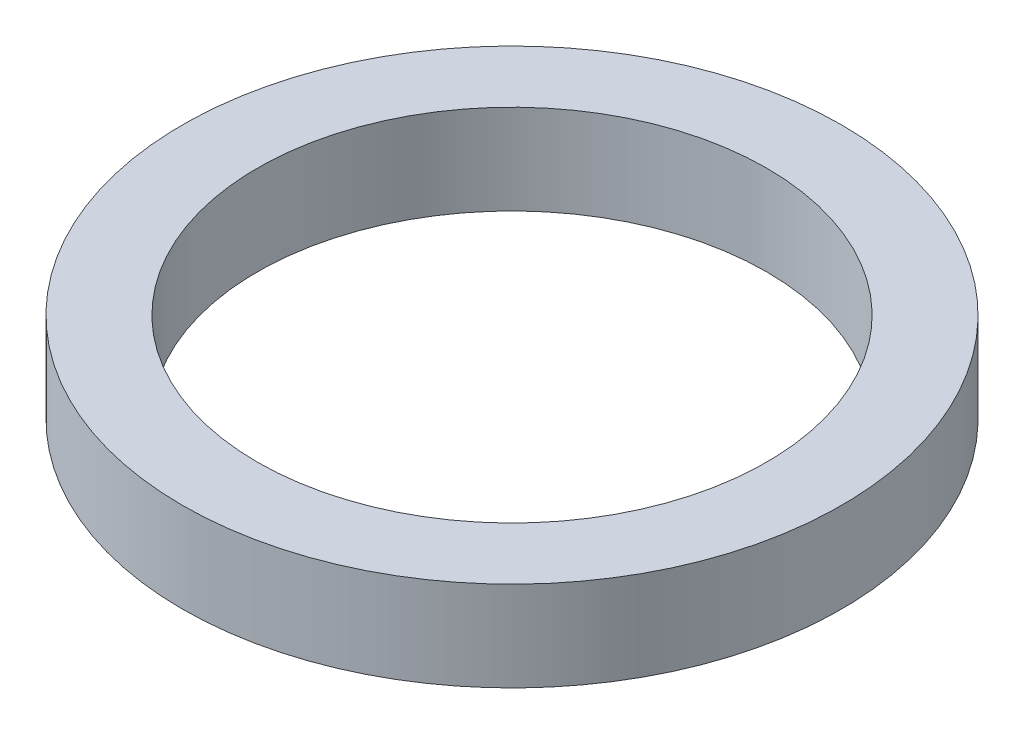
ISO-10303-21;
HEADER;
FILE_DESCRIPTION(('STEP AP214'),'2;1');
FILE_NAME('part.step','',(''),(''),'','','');
FILE_SCHEMA(('AUTOMOTIVE_DESIGN { 1 0 10303 214 1 1 1 1 }'));
ENDSEC;
DATA;
#1=APPLICATION_CONTEXT('core data for automotive mechanical design processes');
#2=APPLICATION_PROTOCOL_DEFINITION('international standard','automotive_design',2000,#1);
#3=PRODUCT_CONTEXT('',#1,'mechanical');
#4=PRODUCT('Part','Part','',(#3));
#5=PRODUCT_RELATED_PRODUCT_CATEGORY('part','',(#4));
#6=PRODUCT_DEFINITION_FORMATION('','',#4);
#7=PRODUCT_DEFINITION_CONTEXT('part definition',#1,'design');
#8=PRODUCT_DEFINITION('design','',#6,#7);
#9=PRODUCT_DEFINITION_SHAPE('','',#8);
#10=(LENGTH_UNIT() NAMED_UNIT(*) SI_UNIT(.MILLI.,.METRE.));
#11=(NAMED_UNIT(*) PLANE_ANGLE_UNIT() SI_UNIT($,.RADIAN.));
#12=(NAMED_UNIT(*) SI_UNIT($,.STERADIAN.) SOLID_ANGLE_UNIT());
#13=UNCERTAINTY_MEASURE_WITH_UNIT(LENGTH_MEASURE(1.E-05),#10,'distance_accuracy_value','');
#14=(GEOMETRIC_REPRESENTATION_CONTEXT(3) GLOBAL_UNCERTAINTY_ASSIGNED_CONTEXT((#13)) GLOBAL_UNIT_ASSIGNED_CONTEXT((#10,
#11,#12)) REPRESENTATION_CONTEXT('',''));
#15=CARTESIAN_POINT('',(0.,0.,0.));
#16=DIRECTION('',(0.,0.,1.));
#17=DIRECTION('',(1.,0.,0.));
#18=AXIS2_PLACEMENT_3D('',#15,#16,#17);
#19=CARTESIAN_POINT('',(0.,15.,0.));
#20=DIRECTION('',(0.,-1.,0.));
#21=DIRECTION('',(0.,0.,-1.));
#22=AXIS2_PLACEMENT_3D('',#19,#20,#21);
#23=CYLINDRICAL_SURFACE('',#22,55.);
#24=CARTESIAN_POINT('',(0.,15.,0.));
#25=DIRECTION('',(0.,1.,0.));
#26=DIRECTION('',(0.,0.,1.));
#27=AXIS2_PLACEMENT_3D('',#24,#25,#26);
#28=CIRCLE('',#27,55.);
#29=CARTESIAN_POINT('',(0.,15.,55.));
#30=VERTEX_POINT('',#29);
#31=EDGE_CURVE('E10',#30,#30,#28,.T.);
#32=ORIENTED_EDGE('',*,*,#31,.F.);
#33=EDGE_LOOP('',(#32));
#34=FACE_BOUND('',#33,.T.);
#35=CARTESIAN_POINT('',(0.,0.,0.));
#36=DIRECTION('',(0.,1.,0.));
#37=DIRECTION('',(0.,0.,1.));
#38=AXIS2_PLACEMENT_3D('',#35,#36,#37);
#39=CIRCLE('',#38,55.);
#40=CARTESIAN_POINT('',(0.,0.,55.));
#41=VERTEX_POINT('',#40);
#42=EDGE_CURVE('E37',#41,#41,#39,.T.);
#43=ORIENTED_EDGE('',*,*,#42,.T.);
#44=EDGE_LOOP('',(#43));
#45=FACE_BOUND('',#44,.T.);
#46=ADVANCED_FACE('F40',(#34,#45),#23,.T.);
#47=CARTESIAN_POINT('',(0.,15.,0.));
#48=DIRECTION('',(0.,1.,0.));
#49=DIRECTION('',(0.,0.,1.));
#50=AXIS2_PLACEMENT_3D('',#47,#48,#49);
#51=PLANE('',#50);
#52=CARTESIAN_POINT('',(0.,15.,0.));
#53=DIRECTION('',(0.,1.,0.));
#54=DIRECTION('',(0.,0.,1.));
#55=AXIS2_PLACEMENT_3D('',#52,#53,#54);
#56=CIRCLE('',#55,42.5);
#57=CARTESIAN_POINT('',(0.,15.,42.5));
#58=VERTEX_POINT('',#57);
#59=EDGE_CURVE('E50',#58,#58,#56,.T.);
#60=ORIENTED_EDGE('',*,*,#59,.F.);
#61=EDGE_LOOP('',(#60));
#62=FACE_BOUND('',#61,.T.);
#63=ORIENTED_EDGE('',*,*,#31,.T.);
#64=EDGE_LOOP('',(#63));
#65=FACE_BOUND('',#64,.T.);
#66=ADVANCED_FACE('F59',(#62,#65),#51,.T.);
#67=CARTESIAN_POINT('',(0.,0.,0.));
#68=DIRECTION('',(0.,1.,0.));
#69=DIRECTION('',(0.,0.,1.));
#70=AXIS2_PLACEMENT_3D('',#67,#68,#69);
#71=PLANE('',#70);
#72=CARTESIAN_POINT('',(0.,0.,0.));
#73=DIRECTION('',(0.,1.,0.));
#74=DIRECTION('',(0.,0.,1.));
#75=AXIS2_PLACEMENT_3D('',#72,#73,#74);
#76=CIRCLE('',#75,42.5);
#77=CARTESIAN_POINT('',(0.,0.,42.5));
#78=VERTEX_POINT('',#77);
#79=EDGE_CURVE('E47',#78,#78,#76,.T.);
#80=ORIENTED_EDGE('',*,*,#79,.T.);
#81=EDGE_LOOP('',(#80));
#82=FACE_BOUND('',#81,.T.);
#83=ORIENTED_EDGE('',*,*,#42,.F.);
#84=EDGE_LOOP('',(#83));
#85=FACE_BOUND('',#84,.T.);
#86=ADVANCED_FACE('F58',(#82,#85),#71,.F.);
#87=CARTESIAN_POINT('',(0.,15.,0.));
#88=DIRECTION('',(0.,-1.,0.));
#89=DIRECTION('',(0.,0.,-1.));
#90=AXIS2_PLACEMENT_3D('',#87,#88,#89);
#91=CYLINDRICAL_SURFACE('',#90,42.5);
#92=ORIENTED_EDGE('',*,*,#59,.T.);
#93=EDGE_LOOP('',(#92));
#94=FACE_BOUND('',#93,.T.);
#95=ORIENTED_EDGE('',*,*,#79,.F.);
#96=EDGE_LOOP('',(#95));
#97=FACE_BOUND('',#96,.T.);
#98=ADVANCED_FACE('F54',(#94,#97),#91,.F.);
#99=CLOSED_SHELL('',(#46,#66,#86,#98));
#100=MANIFOLD_SOLID_BREP('B2',#99);
#101=ADVANCED_BREP_SHAPE_REPRESENTATION('',(#18,#100),#14);
#102=SHAPE_DEFINITION_REPRESENTATION(#9,#101);
ENDSEC;
END-ISO-10303-21;
